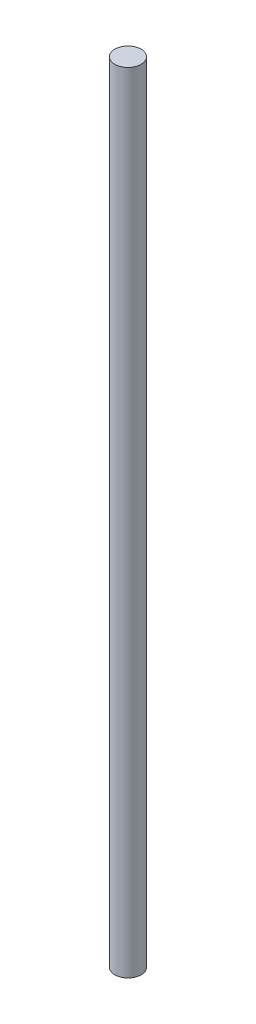
ISO-10303-21;
HEADER;
FILE_DESCRIPTION(('STEP AP214'),'2;1');
FILE_NAME('part.step','',(''),(''),'','','');
FILE_SCHEMA(('AUTOMOTIVE_DESIGN { 1 0 10303 214 1 1 1 1 }'));
ENDSEC;
DATA;
#1=APPLICATION_CONTEXT('core data for automotive mechanical design processes');
#2=APPLICATION_PROTOCOL_DEFINITION('international standard','automotive_design',2000,#1);
#3=PRODUCT_CONTEXT('',#1,'mechanical');
#4=PRODUCT('Part','Part','',(#3));
#5=PRODUCT_RELATED_PRODUCT_CATEGORY('part','',(#4));
#6=PRODUCT_DEFINITION_FORMATION('','',#4);
#7=PRODUCT_DEFINITION_CONTEXT('part definition',#1,'design');
#8=PRODUCT_DEFINITION('design','',#6,#7);
#9=PRODUCT_DEFINITION_SHAPE('','',#8);
#10=(LENGTH_UNIT() NAMED_UNIT(*) SI_UNIT(.MILLI.,.METRE.));
#11=(NAMED_UNIT(*) PLANE_ANGLE_UNIT() SI_UNIT($,.RADIAN.));
#12=(NAMED_UNIT(*) SI_UNIT($,.STERADIAN.) SOLID_ANGLE_UNIT());
#13=UNCERTAINTY_MEASURE_WITH_UNIT(LENGTH_MEASURE(1.E-05),#10,'distance_accuracy_value','');
#14=(GEOMETRIC_REPRESENTATION_CONTEXT(3) GLOBAL_UNCERTAINTY_ASSIGNED_CONTEXT((#13)) GLOBAL_UNIT_ASSIGNED_CONTEXT((#10,
#11,#12)) REPRESENTATION_CONTEXT('',''));
#15=CARTESIAN_POINT('',(0.,0.,0.));
#16=DIRECTION('',(0.,0.,1.));
#17=DIRECTION('',(1.,0.,0.));
#18=AXIS2_PLACEMENT_3D('',#15,#16,#17);
#19=CARTESIAN_POINT('',(0.,240.,0.));
#20=DIRECTION('',(0.,-1.,0.));
#21=DIRECTION('',(0.,0.,-1.));
#22=AXIS2_PLACEMENT_3D('',#19,#20,#21);
#23=CYLINDRICAL_SURFACE('',#22,4.);
#24=CARTESIAN_POINT('',(0.,240.,0.));
#25=DIRECTION('',(0.,1.,0.));
#26=DIRECTION('',(0.,0.,1.));
#27=AXIS2_PLACEMENT_3D('',#24,#25,#26);
#28=CIRCLE('',#27,4.);
#29=CARTESIAN_POINT('',(0.,240.,4.));
#30=VERTEX_POINT('',#29);
#31=EDGE_CURVE('E10',#30,#30,#28,.T.);
#32=ORIENTED_EDGE('',*,*,#31,.F.);
#33=EDGE_LOOP('',(#32));
#34=FACE_BOUND('',#33,.T.);
#35=CARTESIAN_POINT('',(0.,0.,0.));
#36=DIRECTION('',(0.,1.,0.));
#37=DIRECTION('',(0.,0.,1.));
#38=AXIS2_PLACEMENT_3D('',#35,#36,#37);
#39=CIRCLE('',#38,4.);
#40=CARTESIAN_POINT('',(0.,0.,4.));
#41=VERTEX_POINT('',#40);
#42=EDGE_CURVE('E36',#41,#41,#39,.T.);
#43=ORIENTED_EDGE('',*,*,#42,.T.);
#44=EDGE_LOOP('',(#43));
#45=FACE_BOUND('',#44,.T.);
#46=ADVANCED_FACE('F33',(#34,#45),#23,.T.);
#47=CARTESIAN_POINT('',(0.,240.,0.));
#48=DIRECTION('',(0.,1.,0.));
#49=DIRECTION('',(0.,0.,1.));
#50=AXIS2_PLACEMENT_3D('',#47,#48,#49);
#51=PLANE('',#50);
#52=ORIENTED_EDGE('',*,*,#31,.T.);
#53=EDGE_LOOP('',(#52));
#54=FACE_BOUND('',#53,.T.);
#55=ADVANCED_FACE('F48',(#54),#51,.T.);
#56=CARTESIAN_POINT('',(0.,0.,0.));
#57=DIRECTION('',(0.,1.,0.));
#58=DIRECTION('',(0.,0.,1.));
#59=AXIS2_PLACEMENT_3D('',#56,#57,#58);
#60=PLANE('',#59);
#61=ORIENTED_EDGE('',*,*,#42,.F.);
#62=EDGE_LOOP('',(#61));
#63=FACE_BOUND('',#62,.T.);
#64=ADVANCED_FACE('F46',(#63),#60,.F.);
#65=CLOSED_SHELL('',(#46,#55,#64));
#66=MANIFOLD_SOLID_BREP('B2',#65);
#67=ADVANCED_BREP_SHAPE_REPRESENTATION('',(#18,#66),#14);
#68=SHAPE_DEFINITION_REPRESENTATION(#9,#67);
ENDSEC;
END-ISO-10303-21;
